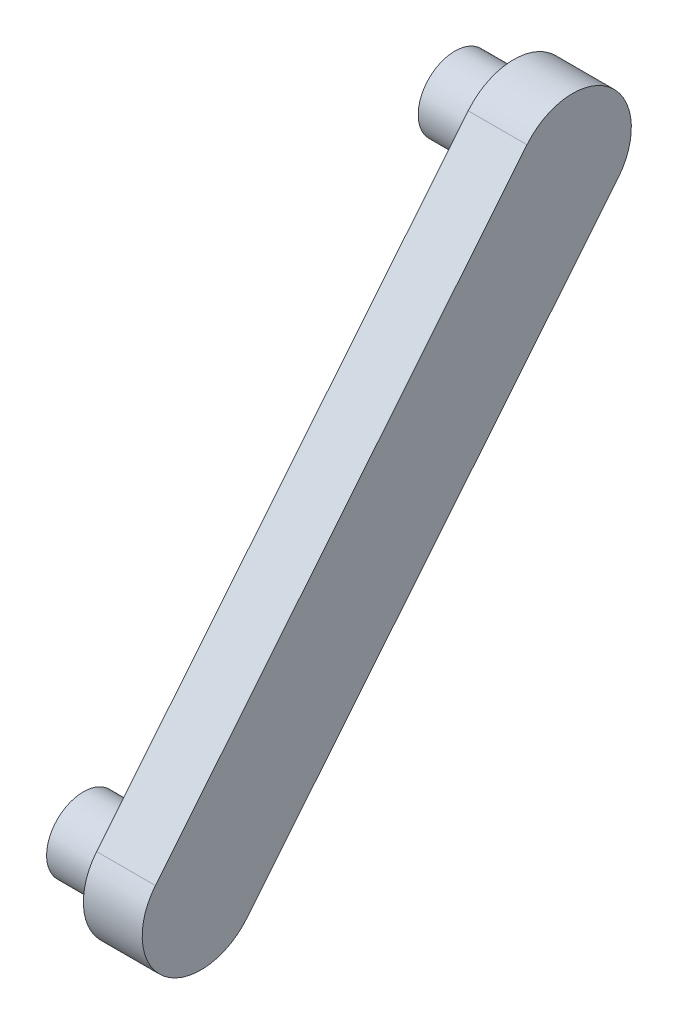
ISO-10303-21;
HEADER;
FILE_DESCRIPTION(('STEP AP214'),'2;1');
FILE_NAME('part.step','',(''),(''),'','','');
FILE_SCHEMA(('AUTOMOTIVE_DESIGN { 1 0 10303 214 1 1 1 1 }'));
ENDSEC;
DATA;
#1=APPLICATION_CONTEXT('core data for automotive mechanical design processes');
#2=APPLICATION_PROTOCOL_DEFINITION('international standard','automotive_design',2000,#1);
#3=PRODUCT_CONTEXT('',#1,'mechanical');
#4=PRODUCT('Part','Part','',(#3));
#5=PRODUCT_RELATED_PRODUCT_CATEGORY('part','',(#4));
#6=PRODUCT_DEFINITION_FORMATION('','',#4);
#7=PRODUCT_DEFINITION_CONTEXT('part definition',#1,'design');
#8=PRODUCT_DEFINITION('design','',#6,#7);
#9=PRODUCT_DEFINITION_SHAPE('','',#8);
#10=(LENGTH_UNIT() NAMED_UNIT(*) SI_UNIT(.MILLI.,.METRE.));
#11=(NAMED_UNIT(*) PLANE_ANGLE_UNIT() SI_UNIT($,.RADIAN.));
#12=(NAMED_UNIT(*) SI_UNIT($,.STERADIAN.) SOLID_ANGLE_UNIT());
#13=UNCERTAINTY_MEASURE_WITH_UNIT(LENGTH_MEASURE(1.E-05),#10,'distance_accuracy_value','');
#14=(GEOMETRIC_REPRESENTATION_CONTEXT(3) GLOBAL_UNCERTAINTY_ASSIGNED_CONTEXT((#13)) GLOBAL_UNIT_ASSIGNED_CONTEXT((#10,
#11,#12)) REPRESENTATION_CONTEXT('',''));
#15=CARTESIAN_POINT('',(0.,0.,0.));
#16=DIRECTION('',(0.,0.,1.));
#17=DIRECTION('',(1.,0.,0.));
#18=AXIS2_PLACEMENT_3D('',#15,#16,#17);
#19=CARTESIAN_POINT('',(99.7397765655112,406.150674005438,505.273375173059));
#20=DIRECTION('',(0.,-0.631899588428942,-0.775050262978688));
#21=DIRECTION('',(0.,0.775050262978688,-0.631899588428942));
#22=AXIS2_PLACEMENT_3D('',#19,#20,#21);
#23=PLANE('',#22);
#24=DIRECTION('',(0.,-0.775050262978688,0.631899588428942));
#25=VECTOR('',#24,1.);
#26=CARTESIAN_POINT('',(93.7397765655112,406.150674005438,505.273375173059));
#27=LINE('',#26,#25);
#28=CARTESIAN_POINT('',(93.7397765655112,428.787405034466,486.817615974107));
#29=VERTEX_POINT('',#28);
#30=CARTESIAN_POINT('',(93.7397765655112,382.284389255744,524.731591279844));
#31=VERTEX_POINT('',#30);
#32=EDGE_CURVE('E97',#29,#31,#27,.T.);
#33=ORIENTED_EDGE('',*,*,#32,.T.);
#34=DIRECTION('',(-1.,0.,0.));
#35=VECTOR('',#34,1.);
#36=CARTESIAN_POINT('',(99.7397765655112,382.284389255744,524.731591279844));
#37=LINE('',#36,#35);
#38=CARTESIAN_POINT('',(99.7397765655112,382.284389255744,524.731591279844));
#39=VERTEX_POINT('',#38);
#40=EDGE_CURVE('E11',#39,#31,#37,.T.);
#41=ORIENTED_EDGE('',*,*,#40,.F.);
#42=DIRECTION('',(0.,-0.775050262978688,0.631899588428942));
#43=VECTOR('',#42,1.);
#44=CARTESIAN_POINT('',(99.7397765655112,406.150674005438,505.273375173059));
#45=LINE('',#44,#43);
#46=CARTESIAN_POINT('',(99.7397765655112,428.787405034466,486.817615974107));
#47=VERTEX_POINT('',#46);
#48=EDGE_CURVE('E81',#47,#39,#45,.T.);
#49=ORIENTED_EDGE('',*,*,#48,.F.);
#50=DIRECTION('',(-1.,0.,0.));
#51=VECTOR('',#50,1.);
#52=CARTESIAN_POINT('',(99.7397765655112,428.787405034466,486.817615974107));
#53=LINE('',#52,#51);
#54=EDGE_CURVE('E93',#47,#29,#53,.T.);
#55=ORIENTED_EDGE('',*,*,#54,.T.);
#56=EDGE_LOOP('',(#33,#41,#49,#55));
#57=FACE_BOUND('',#56,.T.);
#58=ADVANCED_FACE('F34',(#57),#23,.F.);
#59=CARTESIAN_POINT('',(99.7397765655112,378.492991725171,520.081289701971));
#60=DIRECTION('',(-1.,0.,0.));
#61=DIRECTION('',(0.,0.,1.));
#62=AXIS2_PLACEMENT_3D('',#59,#60,#61);
#63=CYLINDRICAL_SURFACE('',#62,6.00000000000002);
#64=CARTESIAN_POINT('',(93.7397765655112,378.492991725171,520.081289701971));
#65=DIRECTION('',(1.,0.,0.));
#66=DIRECTION('',(0.,0.,-1.));
#67=AXIS2_PLACEMENT_3D('',#64,#65,#66);
#68=CIRCLE('',#67,6.00000000000002);
#69=CARTESIAN_POINT('',(93.7397765655112,374.701594194597,515.430988124099));
#70=VERTEX_POINT('',#69);
#71=EDGE_CURVE('E88',#31,#70,#68,.T.);
#72=ORIENTED_EDGE('',*,*,#71,.T.);
#73=DIRECTION('',(-1.,0.,0.));
#74=VECTOR('',#73,1.);
#75=CARTESIAN_POINT('',(99.7397765655112,374.701594194597,515.430988124099));
#76=LINE('',#75,#74);
#77=CARTESIAN_POINT('',(99.7397765655112,374.701594194597,515.430988124099));
#78=VERTEX_POINT('',#77);
#79=EDGE_CURVE('E42',#78,#70,#76,.T.);
#80=ORIENTED_EDGE('',*,*,#79,.F.);
#81=CARTESIAN_POINT('',(99.7397765655112,378.492991725171,520.081289701971));
#82=DIRECTION('',(1.,0.,0.));
#83=DIRECTION('',(0.,0.,-1.));
#84=AXIS2_PLACEMENT_3D('',#81,#82,#83);
#85=CIRCLE('',#84,6.00000000000002);
#86=EDGE_CURVE('E76',#39,#78,#85,.T.);
#87=ORIENTED_EDGE('',*,*,#86,.F.);
#88=ORIENTED_EDGE('',*,*,#40,.T.);
#89=EDGE_LOOP('',(#72,#80,#87,#88));
#90=FACE_BOUND('',#89,.T.);
#91=ADVANCED_FACE('F86',(#90),#63,.T.);
#92=CARTESIAN_POINT('',(99.7397765655112,398.567878944291,495.972772017315));
#93=DIRECTION('',(0.,-0.631899588428942,-0.775050262978688));
#94=DIRECTION('',(0.,0.775050262978688,-0.631899588428942));
#95=AXIS2_PLACEMENT_3D('',#92,#93,#94);
#96=PLANE('',#95);
#97=DIRECTION('',(0.,-0.775050262978688,0.631899588428942));
#98=VECTOR('',#97,1.);
#99=CARTESIAN_POINT('',(93.7397765655112,398.567878944291,495.972772017315));
#100=LINE('',#99,#98);
#101=CARTESIAN_POINT('',(93.7397765655112,421.204609973318,477.517012818363));
#102=VERTEX_POINT('',#101);
#103=EDGE_CURVE('E101',#102,#70,#100,.T.);
#104=ORIENTED_EDGE('',*,*,#103,.F.);
#105=DIRECTION('',(-1.,0.,0.));
#106=VECTOR('',#105,1.);
#107=CARTESIAN_POINT('',(99.7397765655112,421.204609973318,477.517012818363));
#108=LINE('',#107,#106);
#109=CARTESIAN_POINT('',(99.7397765655112,421.204609973318,477.517012818363));
#110=VERTEX_POINT('',#109);
#111=EDGE_CURVE('E66',#110,#102,#108,.T.);
#112=ORIENTED_EDGE('',*,*,#111,.F.);
#113=DIRECTION('',(0.,-0.775050262978688,0.631899588428942));
#114=VECTOR('',#113,1.);
#115=CARTESIAN_POINT('',(99.7397765655112,398.567878944291,495.972772017315));
#116=LINE('',#115,#114);
#117=EDGE_CURVE('E79',#110,#78,#116,.T.);
#118=ORIENTED_EDGE('',*,*,#117,.T.);
#119=ORIENTED_EDGE('',*,*,#79,.T.);
#120=EDGE_LOOP('',(#104,#112,#118,#119));
#121=FACE_BOUND('',#120,.T.);
#122=ADVANCED_FACE('F91',(#121),#96,.T.);
#123=CARTESIAN_POINT('',(99.7397765655112,424.996007503892,482.167314396235));
#124=DIRECTION('',(-1.,0.,0.));
#125=DIRECTION('',(0.,0.,1.));
#126=AXIS2_PLACEMENT_3D('',#123,#124,#125);
#127=CYLINDRICAL_SURFACE('',#126,6.00000000000001);
#128=CARTESIAN_POINT('',(93.7397765655112,424.996007503892,482.167314396235));
#129=DIRECTION('',(1.,0.,0.));
#130=DIRECTION('',(0.,0.,-1.));
#131=AXIS2_PLACEMENT_3D('',#128,#129,#130);
#132=CIRCLE('',#131,6.00000000000001);
#133=EDGE_CURVE('E69',#102,#29,#132,.T.);
#134=ORIENTED_EDGE('',*,*,#133,.T.);
#135=ORIENTED_EDGE('',*,*,#54,.F.);
#136=CARTESIAN_POINT('',(99.7397765655112,424.996007503892,482.167314396235));
#137=DIRECTION('',(1.,0.,0.));
#138=DIRECTION('',(0.,0.,-1.));
#139=AXIS2_PLACEMENT_3D('',#136,#137,#138);
#140=CIRCLE('',#139,6.00000000000001);
#141=EDGE_CURVE('E50',#110,#47,#140,.T.);
#142=ORIENTED_EDGE('',*,*,#141,.F.);
#143=ORIENTED_EDGE('',*,*,#111,.T.);
#144=EDGE_LOOP('',(#134,#135,#142,#143));
#145=FACE_BOUND('',#144,.T.);
#146=ADVANCED_FACE('F153',(#145),#127,.T.);
#147=CARTESIAN_POINT('',(99.7397765655112,341.482824672352,425.955656741738));
#148=DIRECTION('',(1.,0.,0.));
#149=DIRECTION('',(0.,0.,-1.));
#150=AXIS2_PLACEMENT_3D('',#147,#148,#149);
#151=PLANE('',#150);
#152=ORIENTED_EDGE('',*,*,#48,.T.);
#153=ORIENTED_EDGE('',*,*,#86,.T.);
#154=ORIENTED_EDGE('',*,*,#117,.F.);
#155=ORIENTED_EDGE('',*,*,#141,.T.);
#156=EDGE_LOOP('',(#152,#153,#154,#155));
#157=FACE_BOUND('',#156,.T.);
#158=ADVANCED_FACE('F77',(#157),#151,.T.);
#159=CARTESIAN_POINT('',(93.7397765655112,341.482824672352,425.955656741738));
#160=DIRECTION('',(1.,0.,0.));
#161=DIRECTION('',(0.,0.,-1.));
#162=AXIS2_PLACEMENT_3D('',#159,#160,#161);
#163=PLANE('',#162);
#164=CARTESIAN_POINT('',(93.7397765655112,424.996007503892,482.167314396235));
#165=DIRECTION('',(1.,0.,0.));
#166=DIRECTION('',(0.,0.,-1.));
#167=AXIS2_PLACEMENT_3D('',#164,#165,#166);
#168=CIRCLE('',#167,3.75);
#169=CARTESIAN_POINT('',(93.7397765655112,424.996007503892,478.417314396235));
#170=VERTEX_POINT('',#169);
#171=EDGE_CURVE('E123',#170,#170,#168,.T.);
#172=ORIENTED_EDGE('',*,*,#171,.T.);
#173=EDGE_LOOP('',(#172));
#174=FACE_BOUND('',#173,.T.);
#175=ORIENTED_EDGE('',*,*,#103,.T.);
#176=ORIENTED_EDGE('',*,*,#71,.F.);
#177=ORIENTED_EDGE('',*,*,#32,.F.);
#178=ORIENTED_EDGE('',*,*,#133,.F.);
#179=EDGE_LOOP('',(#175,#176,#177,#178));
#180=FACE_BOUND('',#179,.T.);
#181=CARTESIAN_POINT('',(93.7397765655112,378.492991725171,520.081289701971));
#182=DIRECTION('',(1.,0.,0.));
#183=DIRECTION('',(0.,0.,-1.));
#184=AXIS2_PLACEMENT_3D('',#181,#182,#183);
#185=CIRCLE('',#184,3.75);
#186=CARTESIAN_POINT('',(93.7397765655112,378.492991725171,516.331289701971));
#187=VERTEX_POINT('',#186);
#188=EDGE_CURVE('E116',#187,#187,#185,.T.);
#189=ORIENTED_EDGE('',*,*,#188,.T.);
#190=EDGE_LOOP('',(#189));
#191=FACE_BOUND('',#190,.T.);
#192=ADVANCED_FACE('F108',(#174,#180,#191),#163,.F.);
#193=CARTESIAN_POINT('',(87.7397765655112,378.492991725171,520.081289701971));
#194=DIRECTION('',(1.,0.,0.));
#195=DIRECTION('',(0.,0.,-1.));
#196=AXIS2_PLACEMENT_3D('',#193,#194,#195);
#197=CYLINDRICAL_SURFACE('',#196,3.75);
#198=CARTESIAN_POINT('',(87.7397765655112,378.492991725171,520.081289701971));
#199=DIRECTION('',(1.,0.,0.));
#200=DIRECTION('',(0.,0.,-1.));
#201=AXIS2_PLACEMENT_3D('',#198,#199,#200);
#202=CIRCLE('',#201,3.75);
#203=CARTESIAN_POINT('',(87.7397765655112,378.492991725171,516.331289701971));
#204=VERTEX_POINT('',#203);
#205=EDGE_CURVE('E99',#204,#204,#202,.T.);
#206=ORIENTED_EDGE('',*,*,#205,.T.);
#207=EDGE_LOOP('',(#206));
#208=FACE_BOUND('',#207,.T.);
#209=ORIENTED_EDGE('',*,*,#188,.F.);
#210=EDGE_LOOP('',(#209));
#211=FACE_BOUND('',#210,.T.);
#212=ADVANCED_FACE('F111',(#208,#211),#197,.T.);
#213=CARTESIAN_POINT('',(87.7397765655112,341.482824672352,425.955656741738));
#214=DIRECTION('',(1.,0.,0.));
#215=DIRECTION('',(0.,0.,-1.));
#216=AXIS2_PLACEMENT_3D('',#213,#214,#215);
#217=PLANE('',#216);
#218=ORIENTED_EDGE('',*,*,#205,.F.);
#219=EDGE_LOOP('',(#218));
#220=FACE_BOUND('',#219,.T.);
#221=ADVANCED_FACE('F132',(#220),#217,.F.);
#222=CARTESIAN_POINT('',(87.7397765655112,424.996007503892,482.167314396235));
#223=DIRECTION('',(1.,0.,0.));
#224=DIRECTION('',(0.,0.,-1.));
#225=AXIS2_PLACEMENT_3D('',#222,#223,#224);
#226=CYLINDRICAL_SURFACE('',#225,3.75);
#227=CARTESIAN_POINT('',(87.7397765655112,424.996007503892,482.167314396235));
#228=DIRECTION('',(1.,0.,0.));
#229=DIRECTION('',(0.,0.,-1.));
#230=AXIS2_PLACEMENT_3D('',#227,#228,#229);
#231=CIRCLE('',#230,3.75);
#232=CARTESIAN_POINT('',(87.7397765655112,424.996007503892,478.417314396235));
#233=VERTEX_POINT('',#232);
#234=EDGE_CURVE('E118',#233,#233,#231,.T.);
#235=ORIENTED_EDGE('',*,*,#234,.T.);
#236=EDGE_LOOP('',(#235));
#237=FACE_BOUND('',#236,.T.);
#238=ORIENTED_EDGE('',*,*,#171,.F.);
#239=EDGE_LOOP('',(#238));
#240=FACE_BOUND('',#239,.T.);
#241=ADVANCED_FACE('F129',(#237,#240),#226,.T.);
#242=CARTESIAN_POINT('',(87.7397765655112,341.482824672352,425.955656741738));
#243=DIRECTION('',(1.,0.,0.));
#244=DIRECTION('',(0.,0.,-1.));
#245=AXIS2_PLACEMENT_3D('',#242,#243,#244);
#246=PLANE('',#245);
#247=ORIENTED_EDGE('',*,*,#234,.F.);
#248=EDGE_LOOP('',(#247));
#249=FACE_BOUND('',#248,.T.);
#250=ADVANCED_FACE('F131',(#249),#246,.F.);
#251=CLOSED_SHELL('',(#58,#91,#122,#146,#158,#192,#212,#221,#241,#250));
#252=MANIFOLD_SOLID_BREP('B2',#251);
#253=ADVANCED_BREP_SHAPE_REPRESENTATION('',(#18,#252),#14);
#254=SHAPE_DEFINITION_REPRESENTATION(#9,#253);
ENDSEC;
END-ISO-10303-21;
